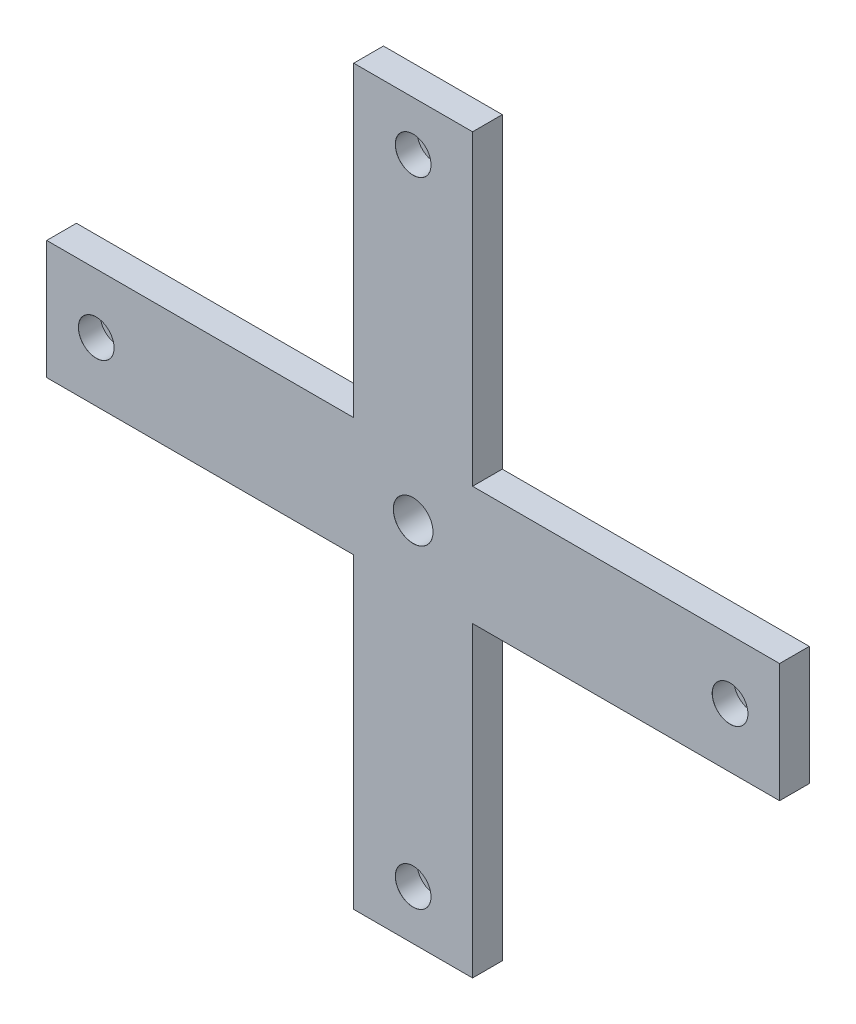
ISO-10303-21;
HEADER;
FILE_DESCRIPTION(('STEP AP214'),'2;1');
FILE_NAME('part.step','',(''),(''),'','','');
FILE_SCHEMA(('AUTOMOTIVE_DESIGN { 1 0 10303 214 1 1 1 1 }'));
ENDSEC;
DATA;
#1=APPLICATION_CONTEXT('core data for automotive mechanical design processes');
#2=APPLICATION_PROTOCOL_DEFINITION('international standard','automotive_design',2000,#1);
#3=PRODUCT_CONTEXT('',#1,'mechanical');
#4=PRODUCT('Part','Part','',(#3));
#5=PRODUCT_RELATED_PRODUCT_CATEGORY('part','',(#4));
#6=PRODUCT_DEFINITION_FORMATION('','',#4);
#7=PRODUCT_DEFINITION_CONTEXT('part definition',#1,'design');
#8=PRODUCT_DEFINITION('design','',#6,#7);
#9=PRODUCT_DEFINITION_SHAPE('','',#8);
#10=(LENGTH_UNIT() NAMED_UNIT(*) SI_UNIT(.MILLI.,.METRE.));
#11=(NAMED_UNIT(*) PLANE_ANGLE_UNIT() SI_UNIT($,.RADIAN.));
#12=(NAMED_UNIT(*) SI_UNIT($,.STERADIAN.) SOLID_ANGLE_UNIT());
#13=UNCERTAINTY_MEASURE_WITH_UNIT(LENGTH_MEASURE(1.E-05),#10,'distance_accuracy_value','');
#14=(GEOMETRIC_REPRESENTATION_CONTEXT(3) GLOBAL_UNCERTAINTY_ASSIGNED_CONTEXT((#13)) GLOBAL_UNIT_ASSIGNED_CONTEXT((#10,
#11,#12)) REPRESENTATION_CONTEXT('',''));
#15=CARTESIAN_POINT('',(0.,0.,0.));
#16=DIRECTION('',(0.,0.,1.));
#17=DIRECTION('',(1.,0.,0.));
#18=AXIS2_PLACEMENT_3D('',#15,#16,#17);
#19=CARTESIAN_POINT('',(185.,185.,15.));
#20=DIRECTION('',(-1.,0.,0.));
#21=DIRECTION('',(0.,-1.,0.));
#22=AXIS2_PLACEMENT_3D('',#19,#20,#21);
#23=PLANE('',#22);
#24=DIRECTION('',(0.,1.,0.));
#25=VECTOR('',#24,1.);
#26=CARTESIAN_POINT('',(185.,185.,15.));
#27=LINE('',#26,#25);
#28=CARTESIAN_POINT('',(185.,-30.,15.));
#29=VERTEX_POINT('',#28);
#30=CARTESIAN_POINT('',(185.,30.,15.));
#31=VERTEX_POINT('',#30);
#32=EDGE_CURVE('E166',#29,#31,#27,.T.);
#33=ORIENTED_EDGE('',*,*,#32,.F.);
#34=DIRECTION('',(0.,0.,1.));
#35=VECTOR('',#34,1.);
#36=CARTESIAN_POINT('',(185.,-30.,-5.));
#37=LINE('',#36,#35);
#38=CARTESIAN_POINT('',(185.,-30.,0.));
#39=VERTEX_POINT('',#38);
#40=EDGE_CURVE('E316',#39,#29,#37,.T.);
#41=ORIENTED_EDGE('',*,*,#40,.F.);
#42=DIRECTION('',(0.,1.,0.));
#43=VECTOR('',#42,1.);
#44=CARTESIAN_POINT('',(185.,185.,0.));
#45=LINE('',#44,#43);
#46=CARTESIAN_POINT('',(185.,30.,0.));
#47=VERTEX_POINT('',#46);
#48=EDGE_CURVE('E170',#39,#47,#45,.T.);
#49=ORIENTED_EDGE('',*,*,#48,.T.);
#50=DIRECTION('',(0.,0.,1.));
#51=VECTOR('',#50,1.);
#52=CARTESIAN_POINT('',(185.,30.,-5.));
#53=LINE('',#52,#51);
#54=EDGE_CURVE('E175',#47,#31,#53,.T.);
#55=ORIENTED_EDGE('',*,*,#54,.T.);
#56=EDGE_LOOP('',(#33,#41,#49,#55));
#57=FACE_BOUND('',#56,.T.);
#58=ADVANCED_FACE('F39',(#57),#23,.F.);
#59=CARTESIAN_POINT('',(-185.,185.,15.));
#60=DIRECTION('',(0.,-1.,0.));
#61=DIRECTION('',(0.,0.,-1.));
#62=AXIS2_PLACEMENT_3D('',#59,#60,#61);
#63=PLANE('',#62);
#64=DIRECTION('',(-1.,0.,0.));
#65=VECTOR('',#64,1.);
#66=CARTESIAN_POINT('',(-185.,185.,0.));
#67=LINE('',#66,#65);
#68=CARTESIAN_POINT('',(30.,185.,0.));
#69=VERTEX_POINT('',#68);
#70=CARTESIAN_POINT('',(-30.,185.,0.));
#71=VERTEX_POINT('',#70);
#72=EDGE_CURVE('E174',#69,#71,#67,.T.);
#73=ORIENTED_EDGE('',*,*,#72,.T.);
#74=DIRECTION('',(0.,0.,1.));
#75=VECTOR('',#74,1.);
#76=CARTESIAN_POINT('',(-30.,185.,-5.));
#77=LINE('',#76,#75);
#78=CARTESIAN_POINT('',(-30.,185.,15.));
#79=VERTEX_POINT('',#78);
#80=EDGE_CURVE('E290',#71,#79,#77,.T.);
#81=ORIENTED_EDGE('',*,*,#80,.T.);
#82=DIRECTION('',(-1.,0.,0.));
#83=VECTOR('',#82,1.);
#84=CARTESIAN_POINT('',(-185.,185.,15.));
#85=LINE('',#84,#83);
#86=CARTESIAN_POINT('',(30.,185.,15.));
#87=VERTEX_POINT('',#86);
#88=EDGE_CURVE('E159',#87,#79,#85,.T.);
#89=ORIENTED_EDGE('',*,*,#88,.F.);
#90=DIRECTION('',(0.,0.,1.));
#91=VECTOR('',#90,1.);
#92=CARTESIAN_POINT('',(30.,185.,-5.));
#93=LINE('',#92,#91);
#94=EDGE_CURVE('E330',#69,#87,#93,.T.);
#95=ORIENTED_EDGE('',*,*,#94,.F.);
#96=EDGE_LOOP('',(#73,#81,#89,#95));
#97=FACE_BOUND('',#96,.T.);
#98=ADVANCED_FACE('F358',(#97),#63,.F.);
#99=CARTESIAN_POINT('',(-185.,185.,15.));
#100=DIRECTION('',(1.,0.,0.));
#101=DIRECTION('',(0.,1.,0.));
#102=AXIS2_PLACEMENT_3D('',#99,#100,#101);
#103=PLANE('',#102);
#104=DIRECTION('',(0.,-1.,0.));
#105=VECTOR('',#104,1.);
#106=CARTESIAN_POINT('',(-185.,185.,0.));
#107=LINE('',#106,#105);
#108=CARTESIAN_POINT('',(-185.,30.,0.));
#109=VERTEX_POINT('',#108);
#110=CARTESIAN_POINT('',(-185.,-30.0000000000001,0.));
#111=VERTEX_POINT('',#110);
#112=EDGE_CURVE('E179',#109,#111,#107,.T.);
#113=ORIENTED_EDGE('',*,*,#112,.T.);
#114=DIRECTION('',(0.,0.,1.));
#115=VECTOR('',#114,1.);
#116=CARTESIAN_POINT('',(-185.,-30.0000000000001,-5.));
#117=LINE('',#116,#115);
#118=CARTESIAN_POINT('',(-185.,-30.0000000000001,15.));
#119=VERTEX_POINT('',#118);
#120=EDGE_CURVE('E153',#111,#119,#117,.T.);
#121=ORIENTED_EDGE('',*,*,#120,.T.);
#122=DIRECTION('',(0.,-1.,0.));
#123=VECTOR('',#122,1.);
#124=CARTESIAN_POINT('',(-185.,185.,15.));
#125=LINE('',#124,#123);
#126=CARTESIAN_POINT('',(-185.,30.,15.));
#127=VERTEX_POINT('',#126);
#128=EDGE_CURVE('E150',#127,#119,#125,.T.);
#129=ORIENTED_EDGE('',*,*,#128,.F.);
#130=DIRECTION('',(0.,0.,1.));
#131=VECTOR('',#130,1.);
#132=CARTESIAN_POINT('',(-185.,30.,-5.));
#133=LINE('',#132,#131);
#134=EDGE_CURVE('E130',#109,#127,#133,.T.);
#135=ORIENTED_EDGE('',*,*,#134,.F.);
#136=EDGE_LOOP('',(#113,#121,#129,#135));
#137=FACE_BOUND('',#136,.T.);
#138=ADVANCED_FACE('F156',(#137),#103,.F.);
#139=CARTESIAN_POINT('',(-185.,-185.,15.));
#140=DIRECTION('',(0.,1.,0.));
#141=DIRECTION('',(0.,0.,1.));
#142=AXIS2_PLACEMENT_3D('',#139,#140,#141);
#143=PLANE('',#142);
#144=DIRECTION('',(1.,0.,0.));
#145=VECTOR('',#144,1.);
#146=CARTESIAN_POINT('',(-185.,-185.,0.));
#147=LINE('',#146,#145);
#148=CARTESIAN_POINT('',(-29.9999999999999,-185.,0.));
#149=VERTEX_POINT('',#148);
#150=CARTESIAN_POINT('',(30.,-185.,0.));
#151=VERTEX_POINT('',#150);
#152=EDGE_CURVE('E182',#149,#151,#147,.T.);
#153=ORIENTED_EDGE('',*,*,#152,.T.);
#154=DIRECTION('',(0.,0.,1.));
#155=VECTOR('',#154,1.);
#156=CARTESIAN_POINT('',(30.,-185.,-5.));
#157=LINE('',#156,#155);
#158=CARTESIAN_POINT('',(30.,-185.,15.));
#159=VERTEX_POINT('',#158);
#160=EDGE_CURVE('E301',#151,#159,#157,.T.);
#161=ORIENTED_EDGE('',*,*,#160,.T.);
#162=DIRECTION('',(1.,0.,0.));
#163=VECTOR('',#162,1.);
#164=CARTESIAN_POINT('',(-185.,-185.,15.));
#165=LINE('',#164,#163);
#166=CARTESIAN_POINT('',(-29.9999999999999,-185.,15.));
#167=VERTEX_POINT('',#166);
#168=EDGE_CURVE('E158',#167,#159,#165,.T.);
#169=ORIENTED_EDGE('',*,*,#168,.F.);
#170=DIRECTION('',(0.,0.,1.));
#171=VECTOR('',#170,1.);
#172=CARTESIAN_POINT('',(-29.9999999999999,-185.,-5.));
#173=LINE('',#172,#171);
#174=EDGE_CURVE('E304',#149,#167,#173,.T.);
#175=ORIENTED_EDGE('',*,*,#174,.F.);
#176=EDGE_LOOP('',(#153,#161,#169,#175));
#177=FACE_BOUND('',#176,.T.);
#178=ADVANCED_FACE('F369',(#177),#143,.F.);
#179=CARTESIAN_POINT('',(0.,0.,15.));
#180=DIRECTION('',(0.,0.,1.));
#181=DIRECTION('',(1.,0.,0.));
#182=AXIS2_PLACEMENT_3D('',#179,#180,#181);
#183=PLANE('',#182);
#184=CARTESIAN_POINT('',(0.,0.,15.));
#185=DIRECTION('',(0.,0.,1.));
#186=DIRECTION('',(1.,0.,0.));
#187=AXIS2_PLACEMENT_3D('',#184,#185,#186);
#188=CIRCLE('',#187,10.025);
#189=CARTESIAN_POINT('',(10.025,0.,15.));
#190=VERTEX_POINT('',#189);
#191=EDGE_CURVE('E641',#190,#190,#188,.T.);
#192=ORIENTED_EDGE('',*,*,#191,.F.);
#193=EDGE_LOOP('',(#192));
#194=FACE_BOUND('',#193,.T.);
#195=CARTESIAN_POINT('',(-160.,0.,15.));
#196=DIRECTION('',(0.,0.,1.));
#197=DIRECTION('',(1.,0.,0.));
#198=AXIS2_PLACEMENT_3D('',#195,#196,#197);
#199=CIRCLE('',#198,9.02500000000001);
#200=CARTESIAN_POINT('',(-150.975,0.,15.));
#201=VERTEX_POINT('',#200);
#202=EDGE_CURVE('E647',#201,#201,#199,.T.);
#203=ORIENTED_EDGE('',*,*,#202,.F.);
#204=EDGE_LOOP('',(#203));
#205=FACE_BOUND('',#204,.T.);
#206=CARTESIAN_POINT('',(160.,0.,15.));
#207=DIRECTION('',(0.,0.,1.));
#208=DIRECTION('',(1.,0.,0.));
#209=AXIS2_PLACEMENT_3D('',#206,#207,#208);
#210=CIRCLE('',#209,9.02500000000001);
#211=CARTESIAN_POINT('',(169.025,0.,15.));
#212=VERTEX_POINT('',#211);
#213=EDGE_CURVE('E230',#212,#212,#210,.T.);
#214=ORIENTED_EDGE('',*,*,#213,.F.);
#215=EDGE_LOOP('',(#214));
#216=FACE_BOUND('',#215,.T.);
#217=CARTESIAN_POINT('',(0.,160.,15.));
#218=DIRECTION('',(0.,0.,1.));
#219=DIRECTION('',(1.,0.,0.));
#220=AXIS2_PLACEMENT_3D('',#217,#218,#219);
#221=CIRCLE('',#220,9.025);
#222=CARTESIAN_POINT('',(9.025,160.,15.));
#223=VERTEX_POINT('',#222);
#224=EDGE_CURVE('E225',#223,#223,#221,.T.);
#225=ORIENTED_EDGE('',*,*,#224,.F.);
#226=EDGE_LOOP('',(#225));
#227=FACE_BOUND('',#226,.T.);
#228=CARTESIAN_POINT('',(0.,-160.,15.));
#229=DIRECTION('',(0.,0.,1.));
#230=DIRECTION('',(1.,0.,0.));
#231=AXIS2_PLACEMENT_3D('',#228,#229,#230);
#232=CIRCLE('',#231,9.025);
#233=CARTESIAN_POINT('',(9.02500000000004,-160.,15.));
#234=VERTEX_POINT('',#233);
#235=EDGE_CURVE('E220',#234,#234,#232,.T.);
#236=ORIENTED_EDGE('',*,*,#235,.F.);
#237=EDGE_LOOP('',(#236));
#238=FACE_BOUND('',#237,.T.);
#239=DIRECTION('',(0.,-1.,0.));
#240=VECTOR('',#239,1.);
#241=CARTESIAN_POINT('',(30.,-185.,15.));
#242=LINE('',#241,#240);
#243=CARTESIAN_POINT('',(30.,-30.,15.));
#244=VERTEX_POINT('',#243);
#245=EDGE_CURVE('E313',#244,#159,#242,.T.);
#246=ORIENTED_EDGE('',*,*,#245,.F.);
#247=DIRECTION('',(-1.,0.,0.));
#248=VECTOR('',#247,1.);
#249=CARTESIAN_POINT('',(185.,-30.,15.));
#250=LINE('',#249,#248);
#251=EDGE_CURVE('E214',#29,#244,#250,.T.);
#252=ORIENTED_EDGE('',*,*,#251,.F.);
#253=ORIENTED_EDGE('',*,*,#32,.T.);
#254=DIRECTION('',(1.,0.,0.));
#255=VECTOR('',#254,1.);
#256=CARTESIAN_POINT('',(185.,30.,15.));
#257=LINE('',#256,#255);
#258=CARTESIAN_POINT('',(30.,30.,15.));
#259=VERTEX_POINT('',#258);
#260=EDGE_CURVE('E327',#259,#31,#257,.T.);
#261=ORIENTED_EDGE('',*,*,#260,.F.);
#262=DIRECTION('',(0.,-1.,0.));
#263=VECTOR('',#262,1.);
#264=CARTESIAN_POINT('',(30.,185.,15.));
#265=LINE('',#264,#263);
#266=EDGE_CURVE('E294',#87,#259,#265,.T.);
#267=ORIENTED_EDGE('',*,*,#266,.F.);
#268=ORIENTED_EDGE('',*,*,#88,.T.);
#269=DIRECTION('',(0.,1.,0.));
#270=VECTOR('',#269,1.);
#271=CARTESIAN_POINT('',(-30.,185.,15.));
#272=LINE('',#271,#270);
#273=CARTESIAN_POINT('',(-30.,30.,15.));
#274=VERTEX_POINT('',#273);
#275=EDGE_CURVE('E143',#274,#79,#272,.T.);
#276=ORIENTED_EDGE('',*,*,#275,.F.);
#277=DIRECTION('',(1.,0.,0.));
#278=VECTOR('',#277,1.);
#279=CARTESIAN_POINT('',(-185.,30.,15.));
#280=LINE('',#279,#278);
#281=EDGE_CURVE('E133',#127,#274,#280,.T.);
#282=ORIENTED_EDGE('',*,*,#281,.F.);
#283=ORIENTED_EDGE('',*,*,#128,.T.);
#284=DIRECTION('',(-1.,0.,0.));
#285=VECTOR('',#284,1.);
#286=CARTESIAN_POINT('',(-185.,-30.0000000000001,15.));
#287=LINE('',#286,#285);
#288=CARTESIAN_POINT('',(-30.,-30.,15.));
#289=VERTEX_POINT('',#288);
#290=EDGE_CURVE('E300',#289,#119,#287,.T.);
#291=ORIENTED_EDGE('',*,*,#290,.F.);
#292=DIRECTION('',(0.,1.,0.));
#293=VECTOR('',#292,1.);
#294=CARTESIAN_POINT('',(-29.9999999999999,-185.,15.));
#295=LINE('',#294,#293);
#296=EDGE_CURVE('E297',#167,#289,#295,.T.);
#297=ORIENTED_EDGE('',*,*,#296,.F.);
#298=ORIENTED_EDGE('',*,*,#168,.T.);
#299=EDGE_LOOP('',(#246,#252,#253,#261,#267,#268,#276,#282,#283,#291,#297,#298));
#300=FACE_BOUND('',#299,.T.);
#301=ADVANCED_FACE('F148',(#194,#205,#216,#227,#238,#300),#183,.T.);
#302=CARTESIAN_POINT('',(0.,0.,0.));
#303=DIRECTION('',(0.,0.,1.));
#304=DIRECTION('',(1.,0.,0.));
#305=AXIS2_PLACEMENT_3D('',#302,#303,#304);
#306=PLANE('',#305);
#307=CARTESIAN_POINT('',(0.,0.,0.));
#308=DIRECTION('',(0.,0.,1.));
#309=DIRECTION('',(1.,0.,0.));
#310=AXIS2_PLACEMENT_3D('',#307,#308,#309);
#311=CIRCLE('',#310,10.);
#312=CARTESIAN_POINT('',(10.,0.,0.));
#313=VERTEX_POINT('',#312);
#314=EDGE_CURVE('E42',#313,#313,#311,.T.);
#315=ORIENTED_EDGE('',*,*,#314,.T.);
#316=EDGE_LOOP('',(#315));
#317=FACE_BOUND('',#316,.T.);
#318=CARTESIAN_POINT('',(-160.,0.,0.));
#319=DIRECTION('',(0.,0.,1.));
#320=DIRECTION('',(1.,0.,0.));
#321=AXIS2_PLACEMENT_3D('',#318,#319,#320);
#322=CIRCLE('',#321,5.50000000000001);
#323=CARTESIAN_POINT('',(-154.5,0.,0.));
#324=VERTEX_POINT('',#323);
#325=EDGE_CURVE('E227',#324,#324,#322,.T.);
#326=ORIENTED_EDGE('',*,*,#325,.T.);
#327=EDGE_LOOP('',(#326));
#328=FACE_BOUND('',#327,.T.);
#329=CARTESIAN_POINT('',(160.,0.,0.));
#330=DIRECTION('',(0.,0.,1.));
#331=DIRECTION('',(1.,0.,0.));
#332=AXIS2_PLACEMENT_3D('',#329,#330,#331);
#333=CIRCLE('',#332,5.50000000000001);
#334=CARTESIAN_POINT('',(165.5,0.,0.));
#335=VERTEX_POINT('',#334);
#336=EDGE_CURVE('E222',#335,#335,#333,.T.);
#337=ORIENTED_EDGE('',*,*,#336,.T.);
#338=EDGE_LOOP('',(#337));
#339=FACE_BOUND('',#338,.T.);
#340=CARTESIAN_POINT('',(0.,160.,0.));
#341=DIRECTION('',(0.,0.,1.));
#342=DIRECTION('',(1.,0.,0.));
#343=AXIS2_PLACEMENT_3D('',#340,#341,#342);
#344=CIRCLE('',#343,5.5);
#345=CARTESIAN_POINT('',(5.5,160.,0.));
#346=VERTEX_POINT('',#345);
#347=EDGE_CURVE('E216',#346,#346,#344,.T.);
#348=ORIENTED_EDGE('',*,*,#347,.T.);
#349=EDGE_LOOP('',(#348));
#350=FACE_BOUND('',#349,.T.);
#351=CARTESIAN_POINT('',(0.,-160.,0.));
#352=DIRECTION('',(0.,0.,1.));
#353=DIRECTION('',(1.,0.,0.));
#354=AXIS2_PLACEMENT_3D('',#351,#352,#353);
#355=CIRCLE('',#354,5.5);
#356=CARTESIAN_POINT('',(5.50000000000004,-160.,0.));
#357=VERTEX_POINT('',#356);
#358=EDGE_CURVE('E210',#357,#357,#355,.T.);
#359=ORIENTED_EDGE('',*,*,#358,.T.);
#360=EDGE_LOOP('',(#359));
#361=FACE_BOUND('',#360,.T.);
#362=DIRECTION('',(-1.,0.,0.));
#363=VECTOR('',#362,1.);
#364=CARTESIAN_POINT('',(0.,-30.,0.));
#365=LINE('',#364,#363);
#366=CARTESIAN_POINT('',(30.,-30.,0.));
#367=VERTEX_POINT('',#366);
#368=EDGE_CURVE('E48',#39,#367,#365,.T.);
#369=ORIENTED_EDGE('',*,*,#368,.T.);
#370=DIRECTION('',(0.,-1.,0.));
#371=VECTOR('',#370,1.);
#372=CARTESIAN_POINT('',(30.,0.,0.));
#373=LINE('',#372,#371);
#374=EDGE_CURVE('E11',#367,#151,#373,.T.);
#375=ORIENTED_EDGE('',*,*,#374,.T.);
#376=ORIENTED_EDGE('',*,*,#152,.F.);
#377=DIRECTION('',(0.,1.,0.));
#378=VECTOR('',#377,1.);
#379=CARTESIAN_POINT('',(-30.,0.,0.));
#380=LINE('',#379,#378);
#381=CARTESIAN_POINT('',(-30.,-30.,0.));
#382=VERTEX_POINT('',#381);
#383=EDGE_CURVE('E199',#149,#382,#380,.T.);
#384=ORIENTED_EDGE('',*,*,#383,.T.);
#385=DIRECTION('',(-1.,0.,0.));
#386=VECTOR('',#385,1.);
#387=CARTESIAN_POINT('',(0.,-30.,0.));
#388=LINE('',#387,#386);
#389=EDGE_CURVE('E203',#382,#111,#388,.T.);
#390=ORIENTED_EDGE('',*,*,#389,.T.);
#391=ORIENTED_EDGE('',*,*,#112,.F.);
#392=DIRECTION('',(1.,0.,0.));
#393=VECTOR('',#392,1.);
#394=CARTESIAN_POINT('',(0.,30.,0.));
#395=LINE('',#394,#393);
#396=CARTESIAN_POINT('',(-30.,30.,0.));
#397=VERTEX_POINT('',#396);
#398=EDGE_CURVE('E136',#109,#397,#395,.T.);
#399=ORIENTED_EDGE('',*,*,#398,.T.);
#400=DIRECTION('',(0.,1.,0.));
#401=VECTOR('',#400,1.);
#402=CARTESIAN_POINT('',(-30.,0.,0.));
#403=LINE('',#402,#401);
#404=EDGE_CURVE('E195',#397,#71,#403,.T.);
#405=ORIENTED_EDGE('',*,*,#404,.T.);
#406=ORIENTED_EDGE('',*,*,#72,.F.);
#407=DIRECTION('',(0.,-1.,0.));
#408=VECTOR('',#407,1.);
#409=CARTESIAN_POINT('',(30.,0.,0.));
#410=LINE('',#409,#408);
#411=CARTESIAN_POINT('',(30.,30.,0.));
#412=VERTEX_POINT('',#411);
#413=EDGE_CURVE('E164',#69,#412,#410,.T.);
#414=ORIENTED_EDGE('',*,*,#413,.T.);
#415=DIRECTION('',(1.,0.,0.));
#416=VECTOR('',#415,1.);
#417=CARTESIAN_POINT('',(0.,30.,0.));
#418=LINE('',#417,#416);
#419=EDGE_CURVE('E189',#412,#47,#418,.T.);
#420=ORIENTED_EDGE('',*,*,#419,.T.);
#421=ORIENTED_EDGE('',*,*,#48,.F.);
#422=EDGE_LOOP('',(#369,#375,#376,#384,#390,#391,#399,#405,#406,#414,#420,#421));
#423=FACE_BOUND('',#422,.T.);
#424=ADVANCED_FACE('F351',(#317,#328,#339,#350,#361,#423),#306,.F.);
#425=CARTESIAN_POINT('',(185.,30.,-5.));
#426=DIRECTION('',(0.,-1.,0.));
#427=DIRECTION('',(1.,0.,0.));
#428=AXIS2_PLACEMENT_3D('',#425,#426,#427);
#429=PLANE('',#428);
#430=DIRECTION('',(0.,0.,1.));
#431=VECTOR('',#430,1.);
#432=CARTESIAN_POINT('',(30.,30.,-5.));
#433=LINE('',#432,#431);
#434=EDGE_CURVE('E334',#412,#259,#433,.T.);
#435=ORIENTED_EDGE('',*,*,#434,.T.);
#436=ORIENTED_EDGE('',*,*,#260,.T.);
#437=ORIENTED_EDGE('',*,*,#54,.F.);
#438=ORIENTED_EDGE('',*,*,#419,.F.);
#439=EDGE_LOOP('',(#435,#436,#437,#438));
#440=FACE_BOUND('',#439,.T.);
#441=ADVANCED_FACE('F349',(#440),#429,.F.);
#442=CARTESIAN_POINT('',(30.,185.,-5.));
#443=DIRECTION('',(-1.,0.,0.));
#444=DIRECTION('',(0.,-1.,0.));
#445=AXIS2_PLACEMENT_3D('',#442,#443,#444);
#446=PLANE('',#445);
#447=ORIENTED_EDGE('',*,*,#94,.T.);
#448=ORIENTED_EDGE('',*,*,#266,.T.);
#449=ORIENTED_EDGE('',*,*,#434,.F.);
#450=ORIENTED_EDGE('',*,*,#413,.F.);
#451=EDGE_LOOP('',(#447,#448,#449,#450));
#452=FACE_BOUND('',#451,.T.);
#453=ADVANCED_FACE('F355',(#452),#446,.F.);
#454=CARTESIAN_POINT('',(-30.,185.,-5.));
#455=DIRECTION('',(1.,0.,0.));
#456=DIRECTION('',(0.,1.,0.));
#457=AXIS2_PLACEMENT_3D('',#454,#455,#456);
#458=PLANE('',#457);
#459=DIRECTION('',(0.,0.,1.));
#460=VECTOR('',#459,1.);
#461=CARTESIAN_POINT('',(-30.,30.,-5.));
#462=LINE('',#461,#460);
#463=EDGE_CURVE('E142',#397,#274,#462,.T.);
#464=ORIENTED_EDGE('',*,*,#463,.T.);
#465=ORIENTED_EDGE('',*,*,#275,.T.);
#466=ORIENTED_EDGE('',*,*,#80,.F.);
#467=ORIENTED_EDGE('',*,*,#404,.F.);
#468=EDGE_LOOP('',(#464,#465,#466,#467));
#469=FACE_BOUND('',#468,.T.);
#470=ADVANCED_FACE('F361',(#469),#458,.F.);
#471=CARTESIAN_POINT('',(-185.,30.,-5.));
#472=DIRECTION('',(0.,-1.,0.));
#473=DIRECTION('',(1.,0.,0.));
#474=AXIS2_PLACEMENT_3D('',#471,#472,#473);
#475=PLANE('',#474);
#476=ORIENTED_EDGE('',*,*,#134,.T.);
#477=ORIENTED_EDGE('',*,*,#281,.T.);
#478=ORIENTED_EDGE('',*,*,#463,.F.);
#479=ORIENTED_EDGE('',*,*,#398,.F.);
#480=EDGE_LOOP('',(#476,#477,#478,#479));
#481=FACE_BOUND('',#480,.T.);
#482=ADVANCED_FACE('F132',(#481),#475,.F.);
#483=CARTESIAN_POINT('',(-185.,-30.0000000000001,-5.));
#484=DIRECTION('',(0.,1.,0.));
#485=DIRECTION('',(-1.,0.,0.));
#486=AXIS2_PLACEMENT_3D('',#483,#484,#485);
#487=PLANE('',#486);
#488=DIRECTION('',(0.,0.,1.));
#489=VECTOR('',#488,1.);
#490=CARTESIAN_POINT('',(-30.,-30.,-5.));
#491=LINE('',#490,#489);
#492=EDGE_CURVE('E64',#382,#289,#491,.T.);
#493=ORIENTED_EDGE('',*,*,#492,.T.);
#494=ORIENTED_EDGE('',*,*,#290,.T.);
#495=ORIENTED_EDGE('',*,*,#120,.F.);
#496=ORIENTED_EDGE('',*,*,#389,.F.);
#497=EDGE_LOOP('',(#493,#494,#495,#496));
#498=FACE_BOUND('',#497,.T.);
#499=ADVANCED_FACE('F364',(#498),#487,.F.);
#500=CARTESIAN_POINT('',(-29.9999999999999,-185.,-5.));
#501=DIRECTION('',(1.,0.,0.));
#502=DIRECTION('',(0.,1.,0.));
#503=AXIS2_PLACEMENT_3D('',#500,#501,#502);
#504=PLANE('',#503);
#505=ORIENTED_EDGE('',*,*,#174,.T.);
#506=ORIENTED_EDGE('',*,*,#296,.T.);
#507=ORIENTED_EDGE('',*,*,#492,.F.);
#508=ORIENTED_EDGE('',*,*,#383,.F.);
#509=EDGE_LOOP('',(#505,#506,#507,#508));
#510=FACE_BOUND('',#509,.T.);
#511=ADVANCED_FACE('F383',(#510),#504,.F.);
#512=CARTESIAN_POINT('',(30.,-185.,-5.));
#513=DIRECTION('',(-1.,0.,0.));
#514=DIRECTION('',(0.,-1.,0.));
#515=AXIS2_PLACEMENT_3D('',#512,#513,#514);
#516=PLANE('',#515);
#517=DIRECTION('',(0.,0.,1.));
#518=VECTOR('',#517,1.);
#519=CARTESIAN_POINT('',(30.,-30.,-5.));
#520=LINE('',#519,#518);
#521=EDGE_CURVE('E56',#367,#244,#520,.T.);
#522=ORIENTED_EDGE('',*,*,#521,.T.);
#523=ORIENTED_EDGE('',*,*,#245,.T.);
#524=ORIENTED_EDGE('',*,*,#160,.F.);
#525=ORIENTED_EDGE('',*,*,#374,.F.);
#526=EDGE_LOOP('',(#522,#523,#524,#525));
#527=FACE_BOUND('',#526,.T.);
#528=ADVANCED_FACE('F371',(#527),#516,.F.);
#529=CARTESIAN_POINT('',(185.,-30.,-5.));
#530=DIRECTION('',(0.,1.,0.));
#531=DIRECTION('',(-1.,0.,0.));
#532=AXIS2_PLACEMENT_3D('',#529,#530,#531);
#533=PLANE('',#532);
#534=ORIENTED_EDGE('',*,*,#40,.T.);
#535=ORIENTED_EDGE('',*,*,#251,.T.);
#536=ORIENTED_EDGE('',*,*,#521,.F.);
#537=ORIENTED_EDGE('',*,*,#368,.F.);
#538=EDGE_LOOP('',(#534,#535,#536,#537));
#539=FACE_BOUND('',#538,.T.);
#540=ADVANCED_FACE('F372',(#539),#533,.F.);
#541=CARTESIAN_POINT('',(0.,-160.,15.));
#542=DIRECTION('',(0.,0.,1.));
#543=DIRECTION('',(1.,0.,0.));
#544=AXIS2_PLACEMENT_3D('',#541,#542,#543);
#545=CYLINDRICAL_SURFACE('',#544,5.5);
#546=CARTESIAN_POINT('',(0.,-160.,4.));
#547=DIRECTION('',(0.,0.,1.));
#548=DIRECTION('',(1.,0.,0.));
#549=AXIS2_PLACEMENT_3D('',#546,#547,#548);
#550=CIRCLE('',#549,5.5);
#551=CARTESIAN_POINT('',(5.50000000000004,-160.,4.));
#552=VERTEX_POINT('',#551);
#553=EDGE_CURVE('E215',#552,#552,#550,.T.);
#554=ORIENTED_EDGE('',*,*,#553,.T.);
#555=EDGE_LOOP('',(#554));
#556=FACE_BOUND('',#555,.T.);
#557=ORIENTED_EDGE('',*,*,#358,.F.);
#558=EDGE_LOOP('',(#557));
#559=FACE_BOUND('',#558,.T.);
#560=ADVANCED_FACE('F374',(#556,#559),#545,.F.);
#561=CARTESIAN_POINT('',(5.50000000000004,-160.,4.));
#562=DIRECTION('',(0.,0.,-1.));
#563=DIRECTION('',(-1.,0.,0.));
#564=AXIS2_PLACEMENT_3D('',#561,#562,#563);
#565=PLANE('',#564);
#566=ORIENTED_EDGE('',*,*,#553,.F.);
#567=EDGE_LOOP('',(#566));
#568=FACE_BOUND('',#567,.T.);
#569=CARTESIAN_POINT('',(0.,-160.,4.));
#570=DIRECTION('',(0.,0.,1.));
#571=DIRECTION('',(1.,0.,0.));
#572=AXIS2_PLACEMENT_3D('',#569,#570,#571);
#573=CIRCLE('',#572,9.);
#574=CARTESIAN_POINT('',(9.00000000000004,-160.,4.));
#575=VERTEX_POINT('',#574);
#576=EDGE_CURVE('E281',#575,#575,#573,.T.);
#577=ORIENTED_EDGE('',*,*,#576,.T.);
#578=EDGE_LOOP('',(#577));
#579=FACE_BOUND('',#578,.T.);
#580=ADVANCED_FACE('F380',(#568,#579),#565,.F.);
#581=CARTESIAN_POINT('',(0.,-160.,15.));
#582=DIRECTION('',(0.,0.,1.));
#583=DIRECTION('',(1.,0.,0.));
#584=AXIS2_PLACEMENT_3D('',#581,#582,#583);
#585=CYLINDRICAL_SURFACE('',#584,9.);
#586=ORIENTED_EDGE('',*,*,#576,.F.);
#587=EDGE_LOOP('',(#586));
#588=FACE_BOUND('',#587,.T.);
#589=CARTESIAN_POINT('',(0.,-160.,14.975));
#590=DIRECTION('',(0.,0.,1.));
#591=DIRECTION('',(1.,0.,0.));
#592=AXIS2_PLACEMENT_3D('',#589,#590,#591);
#593=CIRCLE('',#592,9.);
#594=CARTESIAN_POINT('',(9.00000000000004,-160.,14.975));
#595=VERTEX_POINT('',#594);
#596=EDGE_CURVE('E277',#595,#595,#593,.T.);
#597=ORIENTED_EDGE('',*,*,#596,.T.);
#598=EDGE_LOOP('',(#597));
#599=FACE_BOUND('',#598,.T.);
#600=ADVANCED_FACE('F461',(#588,#599),#585,.F.);
#601=CARTESIAN_POINT('',(0.,-160.,15.));
#602=DIRECTION('',(0.,0.,1.));
#603=DIRECTION('',(1.,0.,0.));
#604=AXIS2_PLACEMENT_3D('',#601,#602,#603);
#605=CONICAL_SURFACE('',#604,9.025,0.785398163397414);
#606=ORIENTED_EDGE('',*,*,#596,.F.);
#607=EDGE_LOOP('',(#606));
#608=FACE_BOUND('',#607,.T.);
#609=ORIENTED_EDGE('',*,*,#235,.T.);
#610=EDGE_LOOP('',(#609));
#611=FACE_BOUND('',#610,.T.);
#612=ADVANCED_FACE('F471',(#608,#611),#605,.F.);
#613=CARTESIAN_POINT('',(0.,160.,15.));
#614=DIRECTION('',(0.,0.,1.));
#615=DIRECTION('',(1.,0.,0.));
#616=AXIS2_PLACEMENT_3D('',#613,#614,#615);
#617=CYLINDRICAL_SURFACE('',#616,5.5);
#618=CARTESIAN_POINT('',(0.,160.,4.));
#619=DIRECTION('',(0.,0.,1.));
#620=DIRECTION('',(1.,0.,0.));
#621=AXIS2_PLACEMENT_3D('',#618,#619,#620);
#622=CIRCLE('',#621,5.5);
#623=CARTESIAN_POINT('',(5.5,160.,4.));
#624=VERTEX_POINT('',#623);
#625=EDGE_CURVE('E221',#624,#624,#622,.T.);
#626=ORIENTED_EDGE('',*,*,#625,.T.);
#627=EDGE_LOOP('',(#626));
#628=FACE_BOUND('',#627,.T.);
#629=ORIENTED_EDGE('',*,*,#347,.F.);
#630=EDGE_LOOP('',(#629));
#631=FACE_BOUND('',#630,.T.);
#632=ADVANCED_FACE('F481',(#628,#631),#617,.F.);
#633=CARTESIAN_POINT('',(5.5,160.,4.));
#634=DIRECTION('',(0.,0.,-1.));
#635=DIRECTION('',(-1.,0.,0.));
#636=AXIS2_PLACEMENT_3D('',#633,#634,#635);
#637=PLANE('',#636);
#638=ORIENTED_EDGE('',*,*,#625,.F.);
#639=EDGE_LOOP('',(#638));
#640=FACE_BOUND('',#639,.T.);
#641=CARTESIAN_POINT('',(0.,160.,4.));
#642=DIRECTION('',(0.,0.,1.));
#643=DIRECTION('',(1.,0.,0.));
#644=AXIS2_PLACEMENT_3D('',#641,#642,#643);
#645=CIRCLE('',#644,9.);
#646=CARTESIAN_POINT('',(9.,160.,4.));
#647=VERTEX_POINT('',#646);
#648=EDGE_CURVE('E267',#647,#647,#645,.T.);
#649=ORIENTED_EDGE('',*,*,#648,.T.);
#650=EDGE_LOOP('',(#649));
#651=FACE_BOUND('',#650,.T.);
#652=ADVANCED_FACE('F491',(#640,#651),#637,.F.);
#653=CARTESIAN_POINT('',(0.,160.,15.));
#654=DIRECTION('',(0.,0.,1.));
#655=DIRECTION('',(1.,0.,0.));
#656=AXIS2_PLACEMENT_3D('',#653,#654,#655);
#657=CYLINDRICAL_SURFACE('',#656,9.);
#658=ORIENTED_EDGE('',*,*,#648,.F.);
#659=EDGE_LOOP('',(#658));
#660=FACE_BOUND('',#659,.T.);
#661=CARTESIAN_POINT('',(0.,160.,14.975));
#662=DIRECTION('',(0.,0.,1.));
#663=DIRECTION('',(1.,0.,0.));
#664=AXIS2_PLACEMENT_3D('',#661,#662,#663);
#665=CIRCLE('',#664,9.);
#666=CARTESIAN_POINT('',(9.,160.,14.975));
#667=VERTEX_POINT('',#666);
#668=EDGE_CURVE('E263',#667,#667,#665,.T.);
#669=ORIENTED_EDGE('',*,*,#668,.T.);
#670=EDGE_LOOP('',(#669));
#671=FACE_BOUND('',#670,.T.);
#672=ADVANCED_FACE('F501',(#660,#671),#657,.F.);
#673=CARTESIAN_POINT('',(0.,160.,15.));
#674=DIRECTION('',(0.,0.,1.));
#675=DIRECTION('',(1.,0.,0.));
#676=AXIS2_PLACEMENT_3D('',#673,#674,#675);
#677=CONICAL_SURFACE('',#676,9.025,0.785398163397414);
#678=ORIENTED_EDGE('',*,*,#668,.F.);
#679=EDGE_LOOP('',(#678));
#680=FACE_BOUND('',#679,.T.);
#681=ORIENTED_EDGE('',*,*,#224,.T.);
#682=EDGE_LOOP('',(#681));
#683=FACE_BOUND('',#682,.T.);
#684=ADVANCED_FACE('F511',(#680,#683),#677,.F.);
#685=CARTESIAN_POINT('',(160.,0.,15.));
#686=DIRECTION('',(0.,0.,1.));
#687=DIRECTION('',(1.,0.,0.));
#688=AXIS2_PLACEMENT_3D('',#685,#686,#687);
#689=CYLINDRICAL_SURFACE('',#688,5.50000000000001);
#690=CARTESIAN_POINT('',(160.,0.,4.));
#691=DIRECTION('',(0.,0.,1.));
#692=DIRECTION('',(1.,0.,0.));
#693=AXIS2_PLACEMENT_3D('',#690,#691,#692);
#694=CIRCLE('',#693,5.50000000000001);
#695=CARTESIAN_POINT('',(165.5,0.,4.));
#696=VERTEX_POINT('',#695);
#697=EDGE_CURVE('E226',#696,#696,#694,.T.);
#698=ORIENTED_EDGE('',*,*,#697,.T.);
#699=EDGE_LOOP('',(#698));
#700=FACE_BOUND('',#699,.T.);
#701=ORIENTED_EDGE('',*,*,#336,.F.);
#702=EDGE_LOOP('',(#701));
#703=FACE_BOUND('',#702,.T.);
#704=ADVANCED_FACE('F521',(#700,#703),#689,.F.);
#705=CARTESIAN_POINT('',(165.5,0.,4.));
#706=DIRECTION('',(0.,0.,-1.));
#707=DIRECTION('',(-1.,0.,0.));
#708=AXIS2_PLACEMENT_3D('',#705,#706,#707);
#709=PLANE('',#708);
#710=ORIENTED_EDGE('',*,*,#697,.F.);
#711=EDGE_LOOP('',(#710));
#712=FACE_BOUND('',#711,.T.);
#713=CARTESIAN_POINT('',(160.,0.,4.));
#714=DIRECTION('',(0.,0.,1.));
#715=DIRECTION('',(1.,0.,0.));
#716=AXIS2_PLACEMENT_3D('',#713,#714,#715);
#717=CIRCLE('',#716,9.00000000000001);
#718=CARTESIAN_POINT('',(169.,0.,4.));
#719=VERTEX_POINT('',#718);
#720=EDGE_CURVE('E253',#719,#719,#717,.T.);
#721=ORIENTED_EDGE('',*,*,#720,.T.);
#722=EDGE_LOOP('',(#721));
#723=FACE_BOUND('',#722,.T.);
#724=ADVANCED_FACE('F531',(#712,#723),#709,.F.);
#725=CARTESIAN_POINT('',(160.,0.,15.));
#726=DIRECTION('',(0.,0.,1.));
#727=DIRECTION('',(1.,0.,0.));
#728=AXIS2_PLACEMENT_3D('',#725,#726,#727);
#729=CYLINDRICAL_SURFACE('',#728,9.00000000000001);
#730=ORIENTED_EDGE('',*,*,#720,.F.);
#731=EDGE_LOOP('',(#730));
#732=FACE_BOUND('',#731,.T.);
#733=CARTESIAN_POINT('',(160.,0.,14.975));
#734=DIRECTION('',(0.,0.,1.));
#735=DIRECTION('',(1.,0.,0.));
#736=AXIS2_PLACEMENT_3D('',#733,#734,#735);
#737=CIRCLE('',#736,9.00000000000001);
#738=CARTESIAN_POINT('',(169.,0.,14.975));
#739=VERTEX_POINT('',#738);
#740=EDGE_CURVE('E237',#739,#739,#737,.T.);
#741=ORIENTED_EDGE('',*,*,#740,.T.);
#742=EDGE_LOOP('',(#741));
#743=FACE_BOUND('',#742,.T.);
#744=ADVANCED_FACE('F541',(#732,#743),#729,.F.);
#745=CARTESIAN_POINT('',(160.,0.,15.));
#746=DIRECTION('',(0.,0.,1.));
#747=DIRECTION('',(1.,0.,0.));
#748=AXIS2_PLACEMENT_3D('',#745,#746,#747);
#749=CONICAL_SURFACE('',#748,9.02500000000001,0.78539816339731);
#750=ORIENTED_EDGE('',*,*,#740,.F.);
#751=EDGE_LOOP('',(#750));
#752=FACE_BOUND('',#751,.T.);
#753=ORIENTED_EDGE('',*,*,#213,.T.);
#754=EDGE_LOOP('',(#753));
#755=FACE_BOUND('',#754,.T.);
#756=ADVANCED_FACE('F551',(#752,#755),#749,.F.);
#757=CARTESIAN_POINT('',(-160.,0.,15.));
#758=DIRECTION('',(0.,0.,1.));
#759=DIRECTION('',(1.,0.,0.));
#760=AXIS2_PLACEMENT_3D('',#757,#758,#759);
#761=CYLINDRICAL_SURFACE('',#760,5.50000000000001);
#762=CARTESIAN_POINT('',(-160.,0.,4.));
#763=DIRECTION('',(0.,0.,1.));
#764=DIRECTION('',(1.,0.,0.));
#765=AXIS2_PLACEMENT_3D('',#762,#763,#764);
#766=CIRCLE('',#765,5.50000000000001);
#767=CARTESIAN_POINT('',(-154.5,0.,4.));
#768=VERTEX_POINT('',#767);
#769=EDGE_CURVE('E231',#768,#768,#766,.T.);
#770=ORIENTED_EDGE('',*,*,#769,.T.);
#771=EDGE_LOOP('',(#770));
#772=FACE_BOUND('',#771,.T.);
#773=ORIENTED_EDGE('',*,*,#325,.F.);
#774=EDGE_LOOP('',(#773));
#775=FACE_BOUND('',#774,.T.);
#776=ADVANCED_FACE('F561',(#772,#775),#761,.F.);
#777=CARTESIAN_POINT('',(-154.5,0.,4.));
#778=DIRECTION('',(0.,0.,-1.));
#779=DIRECTION('',(-1.,0.,0.));
#780=AXIS2_PLACEMENT_3D('',#777,#778,#779);
#781=PLANE('',#780);
#782=ORIENTED_EDGE('',*,*,#769,.F.);
#783=EDGE_LOOP('',(#782));
#784=FACE_BOUND('',#783,.T.);
#785=CARTESIAN_POINT('',(-160.,0.,4.));
#786=DIRECTION('',(0.,0.,1.));
#787=DIRECTION('',(1.,0.,0.));
#788=AXIS2_PLACEMENT_3D('',#785,#786,#787);
#789=CIRCLE('',#788,9.00000000000001);
#790=CARTESIAN_POINT('',(-151.,0.,4.));
#791=VERTEX_POINT('',#790);
#792=EDGE_CURVE('E240',#791,#791,#789,.T.);
#793=ORIENTED_EDGE('',*,*,#792,.T.);
#794=EDGE_LOOP('',(#793));
#795=FACE_BOUND('',#794,.T.);
#796=ADVANCED_FACE('F571',(#784,#795),#781,.F.);
#797=CARTESIAN_POINT('',(-160.,0.,15.));
#798=DIRECTION('',(0.,0.,1.));
#799=DIRECTION('',(1.,0.,0.));
#800=AXIS2_PLACEMENT_3D('',#797,#798,#799);
#801=CYLINDRICAL_SURFACE('',#800,9.00000000000001);
#802=ORIENTED_EDGE('',*,*,#792,.F.);
#803=EDGE_LOOP('',(#802));
#804=FACE_BOUND('',#803,.T.);
#805=CARTESIAN_POINT('',(-160.,0.,14.975));
#806=DIRECTION('',(0.,0.,1.));
#807=DIRECTION('',(1.,0.,0.));
#808=AXIS2_PLACEMENT_3D('',#805,#806,#807);
#809=CIRCLE('',#808,9.00000000000001);
#810=CARTESIAN_POINT('',(-151.,0.,14.975));
#811=VERTEX_POINT('',#810);
#812=EDGE_CURVE('E246',#811,#811,#809,.T.);
#813=ORIENTED_EDGE('',*,*,#812,.T.);
#814=EDGE_LOOP('',(#813));
#815=FACE_BOUND('',#814,.T.);
#816=ADVANCED_FACE('F580',(#804,#815),#801,.F.);
#817=CARTESIAN_POINT('',(-160.,0.,15.));
#818=DIRECTION('',(0.,0.,1.));
#819=DIRECTION('',(1.,0.,0.));
#820=AXIS2_PLACEMENT_3D('',#817,#818,#819);
#821=CONICAL_SURFACE('',#820,9.02500000000001,0.78539816339731);
#822=ORIENTED_EDGE('',*,*,#812,.F.);
#823=EDGE_LOOP('',(#822));
#824=FACE_BOUND('',#823,.T.);
#825=ORIENTED_EDGE('',*,*,#202,.T.);
#826=EDGE_LOOP('',(#825));
#827=FACE_BOUND('',#826,.T.);
#828=ADVANCED_FACE('F590',(#824,#827),#821,.F.);
#829=CARTESIAN_POINT('',(0.,0.,15.));
#830=DIRECTION('',(0.,0.,1.));
#831=DIRECTION('',(1.,0.,0.));
#832=AXIS2_PLACEMENT_3D('',#829,#830,#831);
#833=CYLINDRICAL_SURFACE('',#832,10.);
#834=CARTESIAN_POINT('',(0.,0.,14.975));
#835=DIRECTION('',(0.,0.,1.));
#836=DIRECTION('',(1.,0.,0.));
#837=AXIS2_PLACEMENT_3D('',#834,#835,#836);
#838=CIRCLE('',#837,10.);
#839=CARTESIAN_POINT('',(10.,0.,14.975));
#840=VERTEX_POINT('',#839);
#841=EDGE_CURVE('E638',#840,#840,#838,.T.);
#842=ORIENTED_EDGE('',*,*,#841,.T.);
#843=EDGE_LOOP('',(#842));
#844=FACE_BOUND('',#843,.T.);
#845=ORIENTED_EDGE('',*,*,#314,.F.);
#846=EDGE_LOOP('',(#845));
#847=FACE_BOUND('',#846,.T.);
#848=ADVANCED_FACE('F600',(#844,#847),#833,.F.);
#849=CARTESIAN_POINT('',(0.,0.,15.));
#850=DIRECTION('',(0.,0.,1.));
#851=DIRECTION('',(1.,0.,0.));
#852=AXIS2_PLACEMENT_3D('',#849,#850,#851);
#853=CONICAL_SURFACE('',#852,10.025,0.785398163397414);
#854=ORIENTED_EDGE('',*,*,#841,.F.);
#855=EDGE_LOOP('',(#854));
#856=FACE_BOUND('',#855,.T.);
#857=ORIENTED_EDGE('',*,*,#191,.T.);
#858=EDGE_LOOP('',(#857));
#859=FACE_BOUND('',#858,.T.);
#860=ADVANCED_FACE('F621',(#856,#859),#853,.F.);
#861=CLOSED_SHELL('',(#58,#98,#138,#178,#301,#424,#441,#453,#470,#482,#499,#511,#528,#540,#560,
#580,#600,#612,#632,#652,#672,#684,#704,#724,#744,#756,#776,#796,#816,#828,#848,#860));
#862=MANIFOLD_SOLID_BREP('B2',#861);
#863=ADVANCED_BREP_SHAPE_REPRESENTATION('',(#18,#862),#14);
#864=SHAPE_DEFINITION_REPRESENTATION(#9,#863);
ENDSEC;
END-ISO-10303-21;
